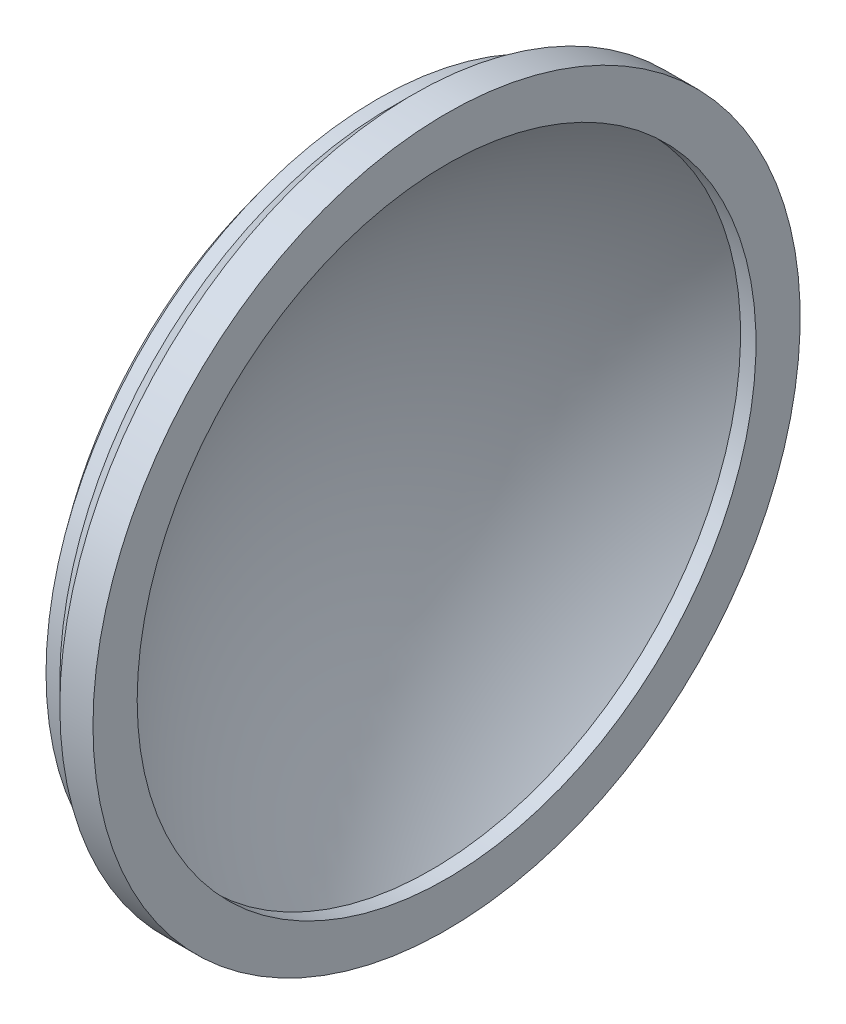
ISO-10303-21;
HEADER;
FILE_DESCRIPTION(('STEP AP214'),'2;1');
FILE_NAME('part.step','',(''),(''),'','','');
FILE_SCHEMA(('AUTOMOTIVE_DESIGN { 1 0 10303 214 1 1 1 1 }'));
ENDSEC;
DATA;
#1=APPLICATION_CONTEXT('core data for automotive mechanical design processes');
#2=APPLICATION_PROTOCOL_DEFINITION('international standard','automotive_design',2000,#1);
#3=PRODUCT_CONTEXT('',#1,'mechanical');
#4=PRODUCT('Part','Part','',(#3));
#5=PRODUCT_RELATED_PRODUCT_CATEGORY('part','',(#4));
#6=PRODUCT_DEFINITION_FORMATION('','',#4);
#7=PRODUCT_DEFINITION_CONTEXT('part definition',#1,'design');
#8=PRODUCT_DEFINITION('design','',#6,#7);
#9=PRODUCT_DEFINITION_SHAPE('','',#8);
#10=(LENGTH_UNIT() NAMED_UNIT(*) SI_UNIT(.MILLI.,.METRE.));
#11=(NAMED_UNIT(*) PLANE_ANGLE_UNIT() SI_UNIT($,.RADIAN.));
#12=(NAMED_UNIT(*) SI_UNIT($,.STERADIAN.) SOLID_ANGLE_UNIT());
#13=UNCERTAINTY_MEASURE_WITH_UNIT(LENGTH_MEASURE(1.E-05),#10,'distance_accuracy_value','');
#14=(GEOMETRIC_REPRESENTATION_CONTEXT(3) GLOBAL_UNCERTAINTY_ASSIGNED_CONTEXT((#13)) GLOBAL_UNIT_ASSIGNED_CONTEXT((#10,
#11,#12)) REPRESENTATION_CONTEXT('',''));
#15=CARTESIAN_POINT('',(0.,0.,0.));
#16=DIRECTION('',(0.,0.,1.));
#17=DIRECTION('',(1.,0.,0.));
#18=AXIS2_PLACEMENT_3D('',#15,#16,#17);
#19=CARTESIAN_POINT('',(45.1545993132812,0.,0.));
#20=DIRECTION('',(-1.,0.,0.));
#21=DIRECTION('',(0.,1.,0.));
#22=AXIS2_PLACEMENT_3D('',#19,#20,#21);
#23=SPHERICAL_SURFACE('',#22,95.);
#24=CARTESIAN_POINT('',(-28.5,0.,0.));
#25=DIRECTION('',(-1.,0.,0.));
#26=DIRECTION('',(0.,0.,1.));
#27=AXIS2_PLACEMENT_3D('',#24,#25,#26);
#28=CIRCLE('',#27,60.);
#29=CARTESIAN_POINT('',(-28.5,0.,60.));
#30=VERTEX_POINT('',#29);
#31=EDGE_CURVE('E64',#30,#30,#28,.T.);
#32=ORIENTED_EDGE('',*,*,#31,.T.);
#33=EDGE_LOOP('',(#32));
#34=FACE_BOUND('',#33,.T.);
#35=ADVANCED_FACE('F37',(#34),#23,.T.);
#36=CARTESIAN_POINT('',(45.1545993132812,0.,0.));
#37=DIRECTION('',(-1.,0.,0.));
#38=DIRECTION('',(0.,1.,0.));
#39=AXIS2_PLACEMENT_3D('',#36,#37,#38);
#40=SPHERICAL_SURFACE('',#39,85.);
#41=CARTESIAN_POINT('',(-18.7906898017115,0.,0.));
#42=DIRECTION('',(-1.,0.,0.));
#43=DIRECTION('',(0.,0.,1.));
#44=AXIS2_PLACEMENT_3D('',#41,#42,#43);
#45=CIRCLE('',#44,56.);
#46=CARTESIAN_POINT('',(-18.7906898017115,0.,56.));
#47=VERTEX_POINT('',#46);
#48=EDGE_CURVE('E10',#47,#47,#45,.T.);
#49=ORIENTED_EDGE('',*,*,#48,.F.);
#50=EDGE_LOOP('',(#49));
#51=FACE_BOUND('',#50,.T.);
#52=ADVANCED_FACE('F95',(#51),#40,.F.);
#53=CARTESIAN_POINT('',(-162.413763561661,0.,0.));
#54=DIRECTION('',(-1.,0.,0.));
#55=DIRECTION('',(0.,0.,1.));
#56=AXIS2_PLACEMENT_3D('',#53,#54,#55);
#57=CYLINDRICAL_SURFACE('',#56,56.);
#58=CARTESIAN_POINT('',(-16.,0.,0.));
#59=DIRECTION('',(-1.,0.,0.));
#60=DIRECTION('',(0.,0.,1.));
#61=AXIS2_PLACEMENT_3D('',#58,#59,#60);
#62=CIRCLE('',#61,56.);
#63=CARTESIAN_POINT('',(-16.,0.,56.));
#64=VERTEX_POINT('',#63);
#65=EDGE_CURVE('E44',#64,#64,#62,.T.);
#66=ORIENTED_EDGE('',*,*,#65,.F.);
#67=EDGE_LOOP('',(#66));
#68=FACE_BOUND('',#67,.T.);
#69=ORIENTED_EDGE('',*,*,#48,.T.);
#70=EDGE_LOOP('',(#69));
#71=FACE_BOUND('',#70,.T.);
#72=ADVANCED_FACE('F90',(#68,#71),#57,.F.);
#73=CARTESIAN_POINT('',(-16.,64.,0.));
#74=DIRECTION('',(-1.,0.,0.));
#75=DIRECTION('',(0.,0.,1.));
#76=AXIS2_PLACEMENT_3D('',#73,#74,#75);
#77=PLANE('',#76);
#78=CARTESIAN_POINT('',(-16.,0.,0.));
#79=DIRECTION('',(-1.,0.,0.));
#80=DIRECTION('',(0.,0.,1.));
#81=AXIS2_PLACEMENT_3D('',#78,#79,#80);
#82=CIRCLE('',#81,64.);
#83=CARTESIAN_POINT('',(-16.,0.,64.));
#84=VERTEX_POINT('',#83);
#85=EDGE_CURVE('E49',#84,#84,#82,.T.);
#86=ORIENTED_EDGE('',*,*,#85,.F.);
#87=EDGE_LOOP('',(#86));
#88=FACE_BOUND('',#87,.T.);
#89=ORIENTED_EDGE('',*,*,#65,.T.);
#90=EDGE_LOOP('',(#89));
#91=FACE_BOUND('',#90,.T.);
#92=ADVANCED_FACE('F85',(#88,#91),#77,.F.);
#93=CARTESIAN_POINT('',(-162.413763561661,0.,0.));
#94=DIRECTION('',(-1.,0.,0.));
#95=DIRECTION('',(0.,0.,1.));
#96=AXIS2_PLACEMENT_3D('',#93,#94,#95);
#97=CYLINDRICAL_SURFACE('',#96,64.);
#98=CARTESIAN_POINT('',(-22.,0.,0.));
#99=DIRECTION('',(-1.,0.,0.));
#100=DIRECTION('',(0.,0.,1.));
#101=AXIS2_PLACEMENT_3D('',#98,#99,#100);
#102=CIRCLE('',#101,64.);
#103=CARTESIAN_POINT('',(-22.,0.,64.));
#104=VERTEX_POINT('',#103);
#105=EDGE_CURVE('E54',#104,#104,#102,.T.);
#106=ORIENTED_EDGE('',*,*,#105,.F.);
#107=EDGE_LOOP('',(#106));
#108=FACE_BOUND('',#107,.T.);
#109=ORIENTED_EDGE('',*,*,#85,.T.);
#110=EDGE_LOOP('',(#109));
#111=FACE_BOUND('',#110,.T.);
#112=ADVANCED_FACE('F79',(#108,#111),#97,.T.);
#113=CARTESIAN_POINT('',(-22.,0.,0.));
#114=DIRECTION('',(1.,0.,0.));
#115=DIRECTION('',(0.,0.,-1.));
#116=AXIS2_PLACEMENT_3D('',#113,#114,#115);
#117=CONICAL_SURFACE('',#116,64.,0.785398163397452);
#118=CARTESIAN_POINT('',(-26.,0.,0.));
#119=DIRECTION('',(-1.,0.,0.));
#120=DIRECTION('',(0.,0.,1.));
#121=AXIS2_PLACEMENT_3D('',#118,#119,#120);
#122=CIRCLE('',#121,60.);
#123=CARTESIAN_POINT('',(-26.,0.,60.));
#124=VERTEX_POINT('',#123);
#125=EDGE_CURVE('E60',#124,#124,#122,.T.);
#126=ORIENTED_EDGE('',*,*,#125,.F.);
#127=EDGE_LOOP('',(#126));
#128=FACE_BOUND('',#127,.T.);
#129=ORIENTED_EDGE('',*,*,#105,.T.);
#130=EDGE_LOOP('',(#129));
#131=FACE_BOUND('',#130,.T.);
#132=ADVANCED_FACE('F73',(#128,#131),#117,.T.);
#133=CARTESIAN_POINT('',(-162.413763561661,0.,0.));
#134=DIRECTION('',(-1.,0.,0.));
#135=DIRECTION('',(0.,0.,1.));
#136=AXIS2_PLACEMENT_3D('',#133,#134,#135);
#137=CYLINDRICAL_SURFACE('',#136,60.);
#138=ORIENTED_EDGE('',*,*,#31,.F.);
#139=EDGE_LOOP('',(#138));
#140=FACE_BOUND('',#139,.T.);
#141=ORIENTED_EDGE('',*,*,#125,.T.);
#142=EDGE_LOOP('',(#141));
#143=FACE_BOUND('',#142,.T.);
#144=ADVANCED_FACE('F70',(#140,#143),#137,.T.);
#145=CLOSED_SHELL('',(#35,#52,#72,#92,#112,#132,#144));
#146=MANIFOLD_SOLID_BREP('B2',#145);
#147=ADVANCED_BREP_SHAPE_REPRESENTATION('',(#18,#146),#14);
#148=SHAPE_DEFINITION_REPRESENTATION(#9,#147);
ENDSEC;
END-ISO-10303-21;
